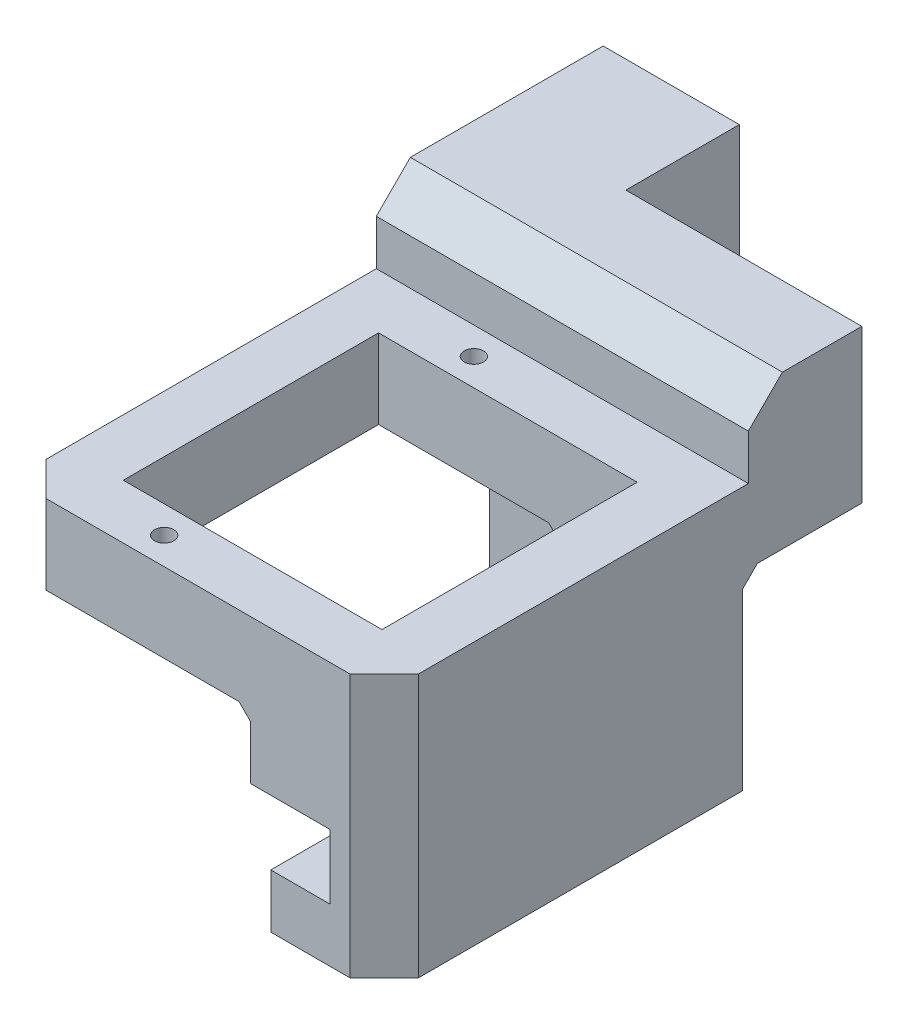
ISO-10303-21;
HEADER;
FILE_DESCRIPTION(('STEP AP214'),'2;1');
FILE_NAME('part.step','',(''),(''),'','','');
FILE_SCHEMA(('AUTOMOTIVE_DESIGN { 1 0 10303 214 1 1 1 1 }'));
ENDSEC;
DATA;
#1=APPLICATION_CONTEXT('core data for automotive mechanical design processes');
#2=APPLICATION_PROTOCOL_DEFINITION('international standard','automotive_design',2000,#1);
#3=PRODUCT_CONTEXT('',#1,'mechanical');
#4=PRODUCT('Part','Part','',(#3));
#5=PRODUCT_RELATED_PRODUCT_CATEGORY('part','',(#4));
#6=PRODUCT_DEFINITION_FORMATION('','',#4);
#7=PRODUCT_DEFINITION_CONTEXT('part definition',#1,'design');
#8=PRODUCT_DEFINITION('design','',#6,#7);
#9=PRODUCT_DEFINITION_SHAPE('','',#8);
#10=(LENGTH_UNIT() NAMED_UNIT(*) SI_UNIT(.MILLI.,.METRE.));
#11=(NAMED_UNIT(*) PLANE_ANGLE_UNIT() SI_UNIT($,.RADIAN.));
#12=(NAMED_UNIT(*) SI_UNIT($,.STERADIAN.) SOLID_ANGLE_UNIT());
#13=UNCERTAINTY_MEASURE_WITH_UNIT(LENGTH_MEASURE(1.E-05),#10,'distance_accuracy_value','');
#14=(GEOMETRIC_REPRESENTATION_CONTEXT(3) GLOBAL_UNCERTAINTY_ASSIGNED_CONTEXT((#13)) GLOBAL_UNIT_ASSIGNED_CONTEXT((#10,
#11,#12)) REPRESENTATION_CONTEXT('',''));
#15=CARTESIAN_POINT('',(0.,0.,0.));
#16=DIRECTION('',(0.,0.,1.));
#17=DIRECTION('',(1.,0.,0.));
#18=AXIS2_PLACEMENT_3D('',#15,#16,#17);
#19=CARTESIAN_POINT('',(0.,7.,-16.05));
#20=DIRECTION('',(0.,0.,1.));
#21=DIRECTION('',(1.,0.,0.));
#22=AXIS2_PLACEMENT_3D('',#19,#20,#21);
#23=PLANE('',#22);
#24=DIRECTION('',(0.,1.,0.));
#25=VECTOR('',#24,1.);
#26=CARTESIAN_POINT('',(28.,7.,-16.05));
#27=LINE('',#26,#25);
#28=CARTESIAN_POINT('',(28.,-11.45,-16.05));
#29=VERTEX_POINT('',#28);
#30=CARTESIAN_POINT('',(28.,-5.75,-16.05));
#31=VERTEX_POINT('',#30);
#32=EDGE_CURVE('E242',#29,#31,#27,.T.);
#33=ORIENTED_EDGE('',*,*,#32,.T.);
#34=DIRECTION('',(-1.,0.,0.));
#35=VECTOR('',#34,1.);
#36=CARTESIAN_POINT('',(0.,-5.75,-16.05));
#37=LINE('',#36,#35);
#38=CARTESIAN_POINT('',(21.,-5.75,-16.05));
#39=VERTEX_POINT('',#38);
#40=EDGE_CURVE('E248',#31,#39,#37,.T.);
#41=ORIENTED_EDGE('',*,*,#40,.T.);
#42=DIRECTION('',(0.,1.,0.));
#43=VECTOR('',#42,1.);
#44=CARTESIAN_POINT('',(21.,0.,-16.05));
#45=LINE('',#44,#43);
#46=CARTESIAN_POINT('',(21.,-1.,-16.05));
#47=VERTEX_POINT('',#46);
#48=EDGE_CURVE('E326',#39,#47,#45,.T.);
#49=ORIENTED_EDGE('',*,*,#48,.T.);
#50=DIRECTION('',(1.,0.,0.));
#51=VECTOR('',#50,1.);
#52=CARTESIAN_POINT('',(0.,-1.,-16.05));
#53=LINE('',#52,#51);
#54=CARTESIAN_POINT('',(32.3,-1.,-16.05));
#55=VERTEX_POINT('',#54);
#56=EDGE_CURVE('E409',#47,#55,#53,.T.);
#57=ORIENTED_EDGE('',*,*,#56,.T.);
#58=DIRECTION('',(0.,-1.,0.));
#59=VECTOR('',#58,1.);
#60=CARTESIAN_POINT('',(32.3,-16.2,-16.05));
#61=LINE('',#60,#59);
#62=CARTESIAN_POINT('',(32.3,-15.7,-16.05));
#63=VERTEX_POINT('',#62);
#64=EDGE_CURVE('E454',#55,#63,#61,.T.);
#65=ORIENTED_EDGE('',*,*,#64,.T.);
#66=DIRECTION('',(-1.,0.,0.));
#67=VECTOR('',#66,1.);
#68=CARTESIAN_POINT('',(0.,-15.7,-16.05));
#69=LINE('',#68,#67);
#70=CARTESIAN_POINT('',(22.8,-15.7,-16.05));
#71=VERTEX_POINT('',#70);
#72=EDGE_CURVE('E452',#63,#71,#69,.T.);
#73=ORIENTED_EDGE('',*,*,#72,.T.);
#74=DIRECTION('',(0.,1.,0.));
#75=VECTOR('',#74,1.);
#76=CARTESIAN_POINT('',(22.8,-16.2,-16.05));
#77=LINE('',#76,#75);
#78=CARTESIAN_POINT('',(22.8,-11.45,-16.05));
#79=VERTEX_POINT('',#78);
#80=EDGE_CURVE('E342',#71,#79,#77,.T.);
#81=ORIENTED_EDGE('',*,*,#80,.T.);
#82=DIRECTION('',(1.,0.,0.));
#83=VECTOR('',#82,1.);
#84=CARTESIAN_POINT('',(0.,-11.45,-16.05));
#85=LINE('',#84,#83);
#86=EDGE_CURVE('E49',#79,#29,#85,.T.);
#87=ORIENTED_EDGE('',*,*,#86,.T.);
#88=EDGE_LOOP('',(#33,#41,#49,#57,#65,#73,#81,#87));
#89=FACE_BOUND('',#88,.T.);
#90=ADVANCED_FACE('F34',(#89),#23,.F.);
#91=CARTESIAN_POINT('',(0.,7.,0.));
#92=DIRECTION('',(0.,-1.,0.));
#93=DIRECTION('',(0.,0.,-1.));
#94=AXIS2_PLACEMENT_3D('',#91,#92,#93);
#95=PLANE('',#94);
#96=DIRECTION('',(0.,0.,-1.));
#97=VECTOR('',#96,1.);
#98=CARTESIAN_POINT('',(27.8,7.,11.25));
#99=LINE('',#98,#97);
#100=CARTESIAN_POINT('',(27.8,7.,11.25));
#101=VERTEX_POINT('',#100);
#102=CARTESIAN_POINT('',(27.8,7.,-11.25));
#103=VERTEX_POINT('',#102);
#104=EDGE_CURVE('E348',#101,#103,#99,.T.);
#105=ORIENTED_EDGE('',*,*,#104,.F.);
#106=DIRECTION('',(-1.,0.,0.));
#107=VECTOR('',#106,1.);
#108=CARTESIAN_POINT('',(17.,7.,11.25));
#109=LINE('',#108,#107);
#110=CARTESIAN_POINT('',(5.,7.,11.25));
#111=VERTEX_POINT('',#110);
#112=EDGE_CURVE('E380',#101,#111,#109,.T.);
#113=ORIENTED_EDGE('',*,*,#112,.T.);
#114=DIRECTION('',(0.,0.,-1.));
#115=VECTOR('',#114,1.);
#116=CARTESIAN_POINT('',(5.,7.,-11.25));
#117=LINE('',#116,#115);
#118=CARTESIAN_POINT('',(5.,7.,-11.25));
#119=VERTEX_POINT('',#118);
#120=EDGE_CURVE('E382',#111,#119,#117,.T.);
#121=ORIENTED_EDGE('',*,*,#120,.T.);
#122=DIRECTION('',(1.,0.,0.));
#123=VECTOR('',#122,1.);
#124=CARTESIAN_POINT('',(17.,7.,-11.25));
#125=LINE('',#124,#123);
#126=EDGE_CURVE('E384',#119,#103,#125,.T.);
#127=ORIENTED_EDGE('',*,*,#126,.T.);
#128=EDGE_LOOP('',(#105,#113,#121,#127));
#129=FACE_BOUND('',#128,.T.);
#130=DIRECTION('',(1.,0.,0.));
#131=VECTOR('',#130,1.);
#132=CARTESIAN_POINT('',(0.,7.,16.05));
#133=LINE('',#132,#131);
#134=CARTESIAN_POINT('',(3.,7.,16.05));
#135=VERTEX_POINT('',#134);
#136=CARTESIAN_POINT('',(29.8,7.,16.05));
#137=VERTEX_POINT('',#136);
#138=EDGE_CURVE('E376',#135,#137,#133,.T.);
#139=ORIENTED_EDGE('',*,*,#138,.T.);
#140=DIRECTION('',(0.707106781186549,0.,-0.707106781186546));
#141=VECTOR('',#140,1.);
#142=CARTESIAN_POINT('',(32.8,7.,13.05));
#143=LINE('',#142,#141);
#144=CARTESIAN_POINT('',(32.8,7.,13.05));
#145=VERTEX_POINT('',#144);
#146=EDGE_CURVE('E424',#137,#145,#143,.T.);
#147=ORIENTED_EDGE('',*,*,#146,.T.);
#148=DIRECTION('',(0.,0.,1.));
#149=VECTOR('',#148,1.);
#150=CARTESIAN_POINT('',(32.8,7.,16.05));
#151=LINE('',#150,#149);
#152=CARTESIAN_POINT('',(32.8,7.,-16.05));
#153=VERTEX_POINT('',#152);
#154=EDGE_CURVE('E351',#153,#145,#151,.T.);
#155=ORIENTED_EDGE('',*,*,#154,.F.);
#156=DIRECTION('',(-1.,0.,0.));
#157=VECTOR('',#156,1.);
#158=CARTESIAN_POINT('',(32.8,7.,-16.05));
#159=LINE('',#158,#157);
#160=CARTESIAN_POINT('',(0.,7.,-16.05));
#161=VERTEX_POINT('',#160);
#162=EDGE_CURVE('E305',#153,#161,#159,.T.);
#163=ORIENTED_EDGE('',*,*,#162,.T.);
#164=DIRECTION('',(0.,0.,1.));
#165=VECTOR('',#164,1.);
#166=CARTESIAN_POINT('',(0.,7.,16.05));
#167=LINE('',#166,#165);
#168=CARTESIAN_POINT('',(0.,7.,13.05));
#169=VERTEX_POINT('',#168);
#170=EDGE_CURVE('E373',#161,#169,#167,.T.);
#171=ORIENTED_EDGE('',*,*,#170,.T.);
#172=DIRECTION('',(-0.707106781186547,0.,-0.707106781186548));
#173=VECTOR('',#172,1.);
#174=CARTESIAN_POINT('',(3.,7.,16.05));
#175=LINE('',#174,#173);
#176=EDGE_CURVE('E422',#169,#135,#175,.F.);
#177=ORIENTED_EDGE('',*,*,#176,.T.);
#178=EDGE_LOOP('',(#139,#147,#155,#163,#171,#177));
#179=FACE_BOUND('',#178,.T.);
#180=CARTESIAN_POINT('',(11.,7.,-13.65));
#181=DIRECTION('',(0.,1.,0.));
#182=DIRECTION('',(0.,0.,1.));
#183=AXIS2_PLACEMENT_3D('',#180,#181,#182);
#184=CIRCLE('',#183,0.85);
#185=CARTESIAN_POINT('',(11.,7.,-12.8));
#186=VERTEX_POINT('',#185);
#187=EDGE_CURVE('E367',#186,#186,#184,.T.);
#188=ORIENTED_EDGE('',*,*,#187,.F.);
#189=EDGE_LOOP('',(#188));
#190=FACE_BOUND('',#189,.T.);
#191=CARTESIAN_POINT('',(11.,7.,13.65));
#192=DIRECTION('',(0.,1.,0.));
#193=DIRECTION('',(0.,0.,-1.));
#194=AXIS2_PLACEMENT_3D('',#191,#192,#193);
#195=CIRCLE('',#194,0.85);
#196=CARTESIAN_POINT('',(11.,7.,12.8));
#197=VERTEX_POINT('',#196);
#198=EDGE_CURVE('E361',#197,#197,#195,.T.);
#199=ORIENTED_EDGE('',*,*,#198,.F.);
#200=EDGE_LOOP('',(#199));
#201=FACE_BOUND('',#200,.T.);
#202=ADVANCED_FACE('F538',(#129,#179,#190,#201),#95,.F.);
#203=CARTESIAN_POINT('',(0.,0.,0.));
#204=DIRECTION('',(0.,-1.,0.));
#205=DIRECTION('',(0.,0.,-1.));
#206=AXIS2_PLACEMENT_3D('',#203,#204,#205);
#207=PLANE('',#206);
#208=DIRECTION('',(-1.,0.,0.));
#209=VECTOR('',#208,1.);
#210=CARTESIAN_POINT('',(17.,0.,11.25));
#211=LINE('',#210,#209);
#212=CARTESIAN_POINT('',(20.,0.,11.25));
#213=VERTEX_POINT('',#212);
#214=CARTESIAN_POINT('',(5.,0.,11.25));
#215=VERTEX_POINT('',#214);
#216=EDGE_CURVE('E392',#213,#215,#211,.T.);
#217=ORIENTED_EDGE('',*,*,#216,.F.);
#218=DIRECTION('',(0.,0.,1.));
#219=VECTOR('',#218,1.);
#220=CARTESIAN_POINT('',(20.,0.,16.05));
#221=LINE('',#220,#219);
#222=CARTESIAN_POINT('',(20.,0.,16.05));
#223=VERTEX_POINT('',#222);
#224=EDGE_CURVE('E469',#213,#223,#221,.T.);
#225=ORIENTED_EDGE('',*,*,#224,.T.);
#226=DIRECTION('',(1.,0.,0.));
#227=VECTOR('',#226,1.);
#228=CARTESIAN_POINT('',(0.,0.,16.05));
#229=LINE('',#228,#227);
#230=CARTESIAN_POINT('',(3.,0.,16.05));
#231=VERTEX_POINT('',#230);
#232=EDGE_CURVE('E389',#231,#223,#229,.T.);
#233=ORIENTED_EDGE('',*,*,#232,.F.);
#234=DIRECTION('',(0.707106781186547,0.,0.707106781186548));
#235=VECTOR('',#234,1.);
#236=CARTESIAN_POINT('',(-6.525,0.,6.52499999999998));
#237=LINE('',#236,#235);
#238=CARTESIAN_POINT('',(0.,0.,13.05));
#239=VERTEX_POINT('',#238);
#240=EDGE_CURVE('E426',#231,#239,#237,.F.);
#241=ORIENTED_EDGE('',*,*,#240,.T.);
#242=DIRECTION('',(0.,0.,1.));
#243=VECTOR('',#242,1.);
#244=CARTESIAN_POINT('',(0.,0.,16.05));
#245=LINE('',#244,#243);
#246=CARTESIAN_POINT('',(0.,0.,-26.05));
#247=VERTEX_POINT('',#246);
#248=EDGE_CURVE('E370',#247,#239,#245,.T.);
#249=ORIENTED_EDGE('',*,*,#248,.F.);
#250=DIRECTION('',(-1.,0.,0.));
#251=VECTOR('',#250,1.);
#252=CARTESIAN_POINT('',(45.0065556157337,0.,-26.05));
#253=LINE('',#252,#251);
#254=CARTESIAN_POINT('',(12.,0.,-26.05));
#255=VERTEX_POINT('',#254);
#256=EDGE_CURVE('E323',#255,#247,#253,.T.);
#257=ORIENTED_EDGE('',*,*,#256,.F.);
#258=CARTESIAN_POINT('',(32.3,0.,-26.05));
#259=VERTEX_POINT('',#258);
#260=EDGE_CURVE('E324',#259,#255,#253,.T.);
#261=ORIENTED_EDGE('',*,*,#260,.F.);
#262=DIRECTION('',(0.,0.,1.));
#263=VECTOR('',#262,1.);
#264=CARTESIAN_POINT('',(32.3,0.,0.));
#265=LINE('',#264,#263);
#266=CARTESIAN_POINT('',(32.3,0.,-17.05));
#267=VERTEX_POINT('',#266);
#268=EDGE_CURVE('E439',#259,#267,#265,.T.);
#269=ORIENTED_EDGE('',*,*,#268,.T.);
#270=DIRECTION('',(-1.,0.,0.));
#271=VECTOR('',#270,1.);
#272=CARTESIAN_POINT('',(0.,0.,-17.05));
#273=LINE('',#272,#271);
#274=CARTESIAN_POINT('',(20.,0.,-17.05));
#275=VERTEX_POINT('',#274);
#276=EDGE_CURVE('E407',#267,#275,#273,.T.);
#277=ORIENTED_EDGE('',*,*,#276,.T.);
#278=DIRECTION('',(0.,0.,1.));
#279=VECTOR('',#278,1.);
#280=CARTESIAN_POINT('',(20.,0.,-11.25));
#281=LINE('',#280,#279);
#282=CARTESIAN_POINT('',(20.,0.,-11.25));
#283=VERTEX_POINT('',#282);
#284=EDGE_CURVE('E460',#275,#283,#281,.T.);
#285=ORIENTED_EDGE('',*,*,#284,.T.);
#286=DIRECTION('',(1.,0.,0.));
#287=VECTOR('',#286,1.);
#288=CARTESIAN_POINT('',(17.,0.,-11.25));
#289=LINE('',#288,#287);
#290=CARTESIAN_POINT('',(5.,0.,-11.25));
#291=VERTEX_POINT('',#290);
#292=EDGE_CURVE('E377',#291,#283,#289,.T.);
#293=ORIENTED_EDGE('',*,*,#292,.F.);
#294=DIRECTION('',(0.,0.,-1.));
#295=VECTOR('',#294,1.);
#296=CARTESIAN_POINT('',(5.,0.,-11.25));
#297=LINE('',#296,#295);
#298=EDGE_CURVE('E396',#215,#291,#297,.T.);
#299=ORIENTED_EDGE('',*,*,#298,.F.);
#300=EDGE_LOOP('',(#217,#225,#233,#241,#249,#257,#261,#269,#277,#285,#293,#299));
#301=FACE_BOUND('',#300,.T.);
#302=CARTESIAN_POINT('',(11.,0.,-13.65));
#303=DIRECTION('',(0.,1.,0.));
#304=DIRECTION('',(0.,0.,1.));
#305=AXIS2_PLACEMENT_3D('',#302,#303,#304);
#306=CIRCLE('',#305,0.85);
#307=CARTESIAN_POINT('',(11.,0.,-12.8));
#308=VERTEX_POINT('',#307);
#309=EDGE_CURVE('E364',#308,#308,#306,.T.);
#310=ORIENTED_EDGE('',*,*,#309,.T.);
#311=EDGE_LOOP('',(#310));
#312=FACE_BOUND('',#311,.T.);
#313=CARTESIAN_POINT('',(11.,0.,13.65));
#314=DIRECTION('',(0.,1.,0.));
#315=DIRECTION('',(0.,0.,-1.));
#316=AXIS2_PLACEMENT_3D('',#313,#314,#315);
#317=CIRCLE('',#316,0.85);
#318=CARTESIAN_POINT('',(11.,0.,12.8));
#319=VERTEX_POINT('',#318);
#320=EDGE_CURVE('E358',#319,#319,#317,.T.);
#321=ORIENTED_EDGE('',*,*,#320,.T.);
#322=EDGE_LOOP('',(#321));
#323=FACE_BOUND('',#322,.T.);
#324=ADVANCED_FACE('F509',(#301,#312,#323),#207,.T.);
#325=CARTESIAN_POINT('',(0.,7.,16.05));
#326=DIRECTION('',(1.,0.,0.));
#327=DIRECTION('',(0.,0.,-1.));
#328=AXIS2_PLACEMENT_3D('',#325,#326,#327);
#329=PLANE('',#328);
#330=DIRECTION('',(0.,1.,0.));
#331=VECTOR('',#330,1.);
#332=CARTESIAN_POINT('',(0.,7.,-16.05));
#333=LINE('',#332,#331);
#334=CARTESIAN_POINT('',(0.,11.,-16.05));
#335=VERTEX_POINT('',#334);
#336=EDGE_CURVE('E309',#161,#335,#333,.T.);
#337=ORIENTED_EDGE('',*,*,#336,.T.);
#338=DIRECTION('',(0.,-0.707106781186546,0.707106781186549));
#339=VECTOR('',#338,1.);
#340=CARTESIAN_POINT('',(0.,11.,-16.05));
#341=LINE('',#340,#339);
#342=CARTESIAN_POINT('',(0.,14.,-19.05));
#343=VERTEX_POINT('',#342);
#344=EDGE_CURVE('E433',#335,#343,#341,.F.);
#345=ORIENTED_EDGE('',*,*,#344,.T.);
#346=DIRECTION('',(0.,0.,1.));
#347=VECTOR('',#346,1.);
#348=CARTESIAN_POINT('',(0.,14.,-26.05));
#349=LINE('',#348,#347);
#350=CARTESIAN_POINT('',(0.,14.,-36.05));
#351=VERTEX_POINT('',#350);
#352=EDGE_CURVE('E315',#351,#343,#349,.T.);
#353=ORIENTED_EDGE('',*,*,#352,.F.);
#354=DIRECTION('',(0.,1.,0.));
#355=VECTOR('',#354,1.);
#356=CARTESIAN_POINT('',(0.,14.,-36.05));
#357=LINE('',#356,#355);
#358=CARTESIAN_POINT('',(0.,-31.14,-36.05));
#359=VERTEX_POINT('',#358);
#360=EDGE_CURVE('E274',#359,#351,#357,.T.);
#361=ORIENTED_EDGE('',*,*,#360,.F.);
#362=DIRECTION('',(0.,0.,1.));
#363=VECTOR('',#362,1.);
#364=CARTESIAN_POINT('',(0.,-31.14,-36.05));
#365=LINE('',#364,#363);
#366=CARTESIAN_POINT('',(0.,-31.14,-26.05));
#367=VERTEX_POINT('',#366);
#368=EDGE_CURVE('E284',#359,#367,#365,.T.);
#369=ORIENTED_EDGE('',*,*,#368,.T.);
#370=DIRECTION('',(0.,1.,0.));
#371=VECTOR('',#370,1.);
#372=CARTESIAN_POINT('',(0.,14.,-26.05));
#373=LINE('',#372,#371);
#374=EDGE_CURVE('E265',#367,#247,#373,.T.);
#375=ORIENTED_EDGE('',*,*,#374,.T.);
#376=ORIENTED_EDGE('',*,*,#248,.T.);
#377=DIRECTION('',(0.,1.,0.));
#378=VECTOR('',#377,1.);
#379=CARTESIAN_POINT('',(0.,7.,13.05));
#380=LINE('',#379,#378);
#381=EDGE_CURVE('E428',#239,#169,#380,.T.);
#382=ORIENTED_EDGE('',*,*,#381,.T.);
#383=ORIENTED_EDGE('',*,*,#170,.F.);
#384=EDGE_LOOP('',(#337,#345,#353,#361,#369,#375,#376,#382,#383));
#385=FACE_BOUND('',#384,.T.);
#386=ADVANCED_FACE('F558',(#385),#329,.F.);
#387=CARTESIAN_POINT('',(0.,7.,16.05));
#388=DIRECTION('',(0.,0.,-1.));
#389=DIRECTION('',(-1.,0.,0.));
#390=AXIS2_PLACEMENT_3D('',#387,#388,#389);
#391=PLANE('',#390);
#392=DIRECTION('',(0.,-1.,0.));
#393=VECTOR('',#392,1.);
#394=CARTESIAN_POINT('',(21.,0.,16.05));
#395=LINE('',#394,#393);
#396=CARTESIAN_POINT('',(21.,-1.00000000000001,16.05));
#397=VERTEX_POINT('',#396);
#398=CARTESIAN_POINT('',(21.,-5.75,16.05));
#399=VERTEX_POINT('',#398);
#400=EDGE_CURVE('E253',#397,#399,#395,.T.);
#401=ORIENTED_EDGE('',*,*,#400,.T.);
#402=DIRECTION('',(-1.,0.,0.));
#403=VECTOR('',#402,1.);
#404=CARTESIAN_POINT('',(21.,-5.75,16.05));
#405=LINE('',#404,#403);
#406=CARTESIAN_POINT('',(28.,-5.75,16.05));
#407=VERTEX_POINT('',#406);
#408=EDGE_CURVE('E56',#407,#399,#405,.T.);
#409=ORIENTED_EDGE('',*,*,#408,.F.);
#410=DIRECTION('',(0.,1.,0.));
#411=VECTOR('',#410,1.);
#412=CARTESIAN_POINT('',(28.,-11.2,16.05));
#413=LINE('',#412,#411);
#414=CARTESIAN_POINT('',(28.,-11.45,16.05));
#415=VERTEX_POINT('',#414);
#416=EDGE_CURVE('E235',#415,#407,#413,.T.);
#417=ORIENTED_EDGE('',*,*,#416,.F.);
#418=DIRECTION('',(1.,0.,0.));
#419=VECTOR('',#418,1.);
#420=CARTESIAN_POINT('',(21.,-11.45,16.05));
#421=LINE('',#420,#419);
#422=CARTESIAN_POINT('',(22.8,-11.45,16.05));
#423=VERTEX_POINT('',#422);
#424=EDGE_CURVE('E255',#423,#415,#421,.T.);
#425=ORIENTED_EDGE('',*,*,#424,.F.);
#426=DIRECTION('',(0.,1.,0.));
#427=VECTOR('',#426,1.);
#428=CARTESIAN_POINT('',(22.8,-16.2,16.05));
#429=LINE('',#428,#427);
#430=CARTESIAN_POINT('',(22.8,-16.2,16.05));
#431=VERTEX_POINT('',#430);
#432=EDGE_CURVE('E243',#431,#423,#429,.T.);
#433=ORIENTED_EDGE('',*,*,#432,.F.);
#434=DIRECTION('',(-1.,0.,0.));
#435=VECTOR('',#434,1.);
#436=CARTESIAN_POINT('',(32.8,-16.2,16.05));
#437=LINE('',#436,#435);
#438=CARTESIAN_POINT('',(29.8,-16.2,16.05));
#439=VERTEX_POINT('',#438);
#440=EDGE_CURVE('E337',#439,#431,#437,.T.);
#441=ORIENTED_EDGE('',*,*,#440,.F.);
#442=DIRECTION('',(0.,1.,0.));
#443=VECTOR('',#442,1.);
#444=CARTESIAN_POINT('',(29.8,7.,16.05));
#445=LINE('',#444,#443);
#446=EDGE_CURVE('E420',#439,#137,#445,.T.);
#447=ORIENTED_EDGE('',*,*,#446,.T.);
#448=ORIENTED_EDGE('',*,*,#138,.F.);
#449=DIRECTION('',(0.,-1.,0.));
#450=VECTOR('',#449,1.);
#451=CARTESIAN_POINT('',(3.,7.,16.05));
#452=LINE('',#451,#450);
#453=EDGE_CURVE('E417',#135,#231,#452,.T.);
#454=ORIENTED_EDGE('',*,*,#453,.T.);
#455=ORIENTED_EDGE('',*,*,#232,.T.);
#456=DIRECTION('',(-0.707106781186552,0.707106781186543,0.));
#457=VECTOR('',#456,1.);
#458=CARTESIAN_POINT('',(6.49999999999984,13.4999999999999,16.05));
#459=LINE('',#458,#457);
#460=EDGE_CURVE('E483',#223,#397,#459,.F.);
#461=ORIENTED_EDGE('',*,*,#460,.T.);
#462=EDGE_LOOP('',(#401,#409,#417,#425,#433,#441,#447,#448,#454,#455,#461));
#463=FACE_BOUND('',#462,.T.);
#464=ADVANCED_FACE('F251',(#463),#391,.F.);
#465=CARTESIAN_POINT('',(17.,7.,11.25));
#466=DIRECTION('',(0.,0.,1.));
#467=DIRECTION('',(1.,0.,0.));
#468=AXIS2_PLACEMENT_3D('',#465,#466,#467);
#469=PLANE('',#468);
#470=DIRECTION('',(0.,-1.,0.));
#471=VECTOR('',#470,1.);
#472=CARTESIAN_POINT('',(27.8,7.,11.25));
#473=LINE('',#472,#471);
#474=CARTESIAN_POINT('',(27.8,0.,11.25));
#475=VERTEX_POINT('',#474);
#476=EDGE_CURVE('E354',#101,#475,#473,.T.);
#477=ORIENTED_EDGE('',*,*,#476,.T.);
#478=CARTESIAN_POINT('',(21.,0.,11.25));
#479=VERTEX_POINT('',#478);
#480=EDGE_CURVE('E393',#475,#479,#211,.T.);
#481=ORIENTED_EDGE('',*,*,#480,.T.);
#482=DIRECTION('',(0.,1.,0.));
#483=VECTOR('',#482,1.);
#484=CARTESIAN_POINT('',(21.,0.,11.25));
#485=LINE('',#484,#483);
#486=CARTESIAN_POINT('',(21.,-1.00000000000001,11.25));
#487=VERTEX_POINT('',#486);
#488=EDGE_CURVE('E478',#487,#479,#485,.T.);
#489=ORIENTED_EDGE('',*,*,#488,.F.);
#490=DIRECTION('',(0.707106781186552,-0.707106781186543,0.));
#491=VECTOR('',#490,1.);
#492=CARTESIAN_POINT('',(15.,4.99999999999994,11.25));
#493=LINE('',#492,#491);
#494=EDGE_CURVE('E485',#487,#213,#493,.F.);
#495=ORIENTED_EDGE('',*,*,#494,.T.);
#496=ORIENTED_EDGE('',*,*,#216,.T.);
#497=DIRECTION('',(0.,-1.,0.));
#498=VECTOR('',#497,1.);
#499=CARTESIAN_POINT('',(5.,7.,11.25));
#500=LINE('',#499,#498);
#501=EDGE_CURVE('E402',#111,#215,#500,.T.);
#502=ORIENTED_EDGE('',*,*,#501,.F.);
#503=ORIENTED_EDGE('',*,*,#112,.F.);
#504=EDGE_LOOP('',(#477,#481,#489,#495,#496,#502,#503));
#505=FACE_BOUND('',#504,.T.);
#506=ADVANCED_FACE('F532',(#505),#469,.F.);
#507=CARTESIAN_POINT('',(5.,7.,-11.25));
#508=DIRECTION('',(-1.,0.,0.));
#509=DIRECTION('',(0.,0.,1.));
#510=AXIS2_PLACEMENT_3D('',#507,#508,#509);
#511=PLANE('',#510);
#512=ORIENTED_EDGE('',*,*,#298,.T.);
#513=DIRECTION('',(0.,-1.,0.));
#514=VECTOR('',#513,1.);
#515=CARTESIAN_POINT('',(5.,7.,-11.25));
#516=LINE('',#515,#514);
#517=EDGE_CURVE('E386',#119,#291,#516,.T.);
#518=ORIENTED_EDGE('',*,*,#517,.F.);
#519=ORIENTED_EDGE('',*,*,#120,.F.);
#520=ORIENTED_EDGE('',*,*,#501,.T.);
#521=EDGE_LOOP('',(#512,#518,#519,#520));
#522=FACE_BOUND('',#521,.T.);
#523=ADVANCED_FACE('F519',(#522),#511,.F.);
#524=CARTESIAN_POINT('',(17.,7.,-11.25));
#525=DIRECTION('',(0.,0.,-1.));
#526=DIRECTION('',(-1.,0.,0.));
#527=AXIS2_PLACEMENT_3D('',#524,#525,#526);
#528=PLANE('',#527);
#529=ORIENTED_EDGE('',*,*,#292,.T.);
#530=DIRECTION('',(-0.707106781186552,0.707106781186543,0.));
#531=VECTOR('',#530,1.);
#532=CARTESIAN_POINT('',(15.,4.99999999999993,-11.25));
#533=LINE('',#532,#531);
#534=CARTESIAN_POINT('',(21.,-1.00000000000001,-11.25));
#535=VERTEX_POINT('',#534);
#536=EDGE_CURVE('E487',#283,#535,#533,.F.);
#537=ORIENTED_EDGE('',*,*,#536,.T.);
#538=DIRECTION('',(0.,-1.,0.));
#539=VECTOR('',#538,1.);
#540=CARTESIAN_POINT('',(21.,0.,-11.25));
#541=LINE('',#540,#539);
#542=CARTESIAN_POINT('',(21.,0.,-11.25));
#543=VERTEX_POINT('',#542);
#544=EDGE_CURVE('E475',#543,#535,#541,.T.);
#545=ORIENTED_EDGE('',*,*,#544,.F.);
#546=DIRECTION('',(1.,0.,0.));
#547=VECTOR('',#546,1.);
#548=CARTESIAN_POINT('',(17.,0.,-11.25));
#549=LINE('',#548,#547);
#550=CARTESIAN_POINT('',(27.8,0.,-11.25));
#551=VERTEX_POINT('',#550);
#552=EDGE_CURVE('E328',#543,#551,#549,.T.);
#553=ORIENTED_EDGE('',*,*,#552,.T.);
#554=DIRECTION('',(0.,-1.,0.));
#555=VECTOR('',#554,1.);
#556=CARTESIAN_POINT('',(27.8,7.,-11.25));
#557=LINE('',#556,#555);
#558=EDGE_CURVE('E355',#103,#551,#557,.T.);
#559=ORIENTED_EDGE('',*,*,#558,.F.);
#560=ORIENTED_EDGE('',*,*,#126,.F.);
#561=ORIENTED_EDGE('',*,*,#517,.T.);
#562=EDGE_LOOP('',(#529,#537,#545,#553,#559,#560,#561));
#563=FACE_BOUND('',#562,.T.);
#564=ADVANCED_FACE('F513',(#563),#528,.F.);
#565=CARTESIAN_POINT('',(11.,7.,-13.65));
#566=DIRECTION('',(0.,-1.,0.));
#567=DIRECTION('',(0.,0.,-1.));
#568=AXIS2_PLACEMENT_3D('',#565,#566,#567);
#569=CYLINDRICAL_SURFACE('',#568,0.85);
#570=ORIENTED_EDGE('',*,*,#187,.T.);
#571=EDGE_LOOP('',(#570));
#572=FACE_BOUND('',#571,.T.);
#573=ORIENTED_EDGE('',*,*,#309,.F.);
#574=EDGE_LOOP('',(#573));
#575=FACE_BOUND('',#574,.T.);
#576=ADVANCED_FACE('F553',(#572,#575),#569,.F.);
#577=CARTESIAN_POINT('',(11.,7.,13.65));
#578=DIRECTION('',(0.,-1.,0.));
#579=DIRECTION('',(0.,0.,-1.));
#580=AXIS2_PLACEMENT_3D('',#577,#578,#579);
#581=CYLINDRICAL_SURFACE('',#580,0.85);
#582=ORIENTED_EDGE('',*,*,#198,.T.);
#583=EDGE_LOOP('',(#582));
#584=FACE_BOUND('',#583,.T.);
#585=ORIENTED_EDGE('',*,*,#320,.F.);
#586=EDGE_LOOP('',(#585));
#587=FACE_BOUND('',#586,.T.);
#588=ADVANCED_FACE('F549',(#584,#587),#581,.F.);
#589=CARTESIAN_POINT('',(32.8,7.,16.05));
#590=DIRECTION('',(1.,0.,0.));
#591=DIRECTION('',(0.,0.,-1.));
#592=AXIS2_PLACEMENT_3D('',#589,#590,#591);
#593=PLANE('',#592);
#594=DIRECTION('',(0.,0.707106781186542,-0.707106781186553));
#595=VECTOR('',#594,1.);
#596=CARTESIAN_POINT('',(32.8,0.353553390593264,-16.6964466094068));
#597=LINE('',#596,#595);
#598=CARTESIAN_POINT('',(32.8,-0.792893218813462,-15.55));
#599=VERTEX_POINT('',#598);
#600=CARTESIAN_POINT('',(32.8,0.5,-16.8428932188135));
#601=VERTEX_POINT('',#600);
#602=EDGE_CURVE('E444',#599,#601,#597,.T.);
#603=ORIENTED_EDGE('',*,*,#602,.T.);
#604=DIRECTION('',(0.,0.,-1.));
#605=VECTOR('',#604,1.);
#606=CARTESIAN_POINT('',(32.8,0.5,16.05));
#607=LINE('',#606,#605);
#608=CARTESIAN_POINT('',(32.8,0.5,-26.05));
#609=VERTEX_POINT('',#608);
#610=EDGE_CURVE('E446',#601,#609,#607,.T.);
#611=ORIENTED_EDGE('',*,*,#610,.T.);
#612=DIRECTION('',(0.,-1.,0.));
#613=VECTOR('',#612,1.);
#614=CARTESIAN_POINT('',(32.8,7.,-26.05));
#615=LINE('',#614,#613);
#616=CARTESIAN_POINT('',(32.8,14.,-26.05));
#617=VERTEX_POINT('',#616);
#618=EDGE_CURVE('E318',#617,#609,#615,.T.);
#619=ORIENTED_EDGE('',*,*,#618,.F.);
#620=DIRECTION('',(0.,0.,1.));
#621=VECTOR('',#620,1.);
#622=CARTESIAN_POINT('',(32.8,14.,-26.05));
#623=LINE('',#622,#621);
#624=CARTESIAN_POINT('',(32.8,14.,-19.05));
#625=VERTEX_POINT('',#624);
#626=EDGE_CURVE('E304',#617,#625,#623,.T.);
#627=ORIENTED_EDGE('',*,*,#626,.T.);
#628=DIRECTION('',(0.,0.707106781186546,-0.707106781186549));
#629=VECTOR('',#628,1.);
#630=CARTESIAN_POINT('',(32.8,-7.04999999999999,2.00000000000008));
#631=LINE('',#630,#629);
#632=CARTESIAN_POINT('',(32.8,11.,-16.05));
#633=VERTEX_POINT('',#632);
#634=EDGE_CURVE('E437',#625,#633,#631,.F.);
#635=ORIENTED_EDGE('',*,*,#634,.T.);
#636=DIRECTION('',(0.,1.,0.));
#637=VECTOR('',#636,1.);
#638=CARTESIAN_POINT('',(32.8,7.,-16.05));
#639=LINE('',#638,#637);
#640=EDGE_CURVE('E306',#153,#633,#639,.T.);
#641=ORIENTED_EDGE('',*,*,#640,.F.);
#642=ORIENTED_EDGE('',*,*,#154,.T.);
#643=DIRECTION('',(0.,-1.,0.));
#644=VECTOR('',#643,1.);
#645=CARTESIAN_POINT('',(32.8,-16.2,13.05));
#646=LINE('',#645,#644);
#647=CARTESIAN_POINT('',(32.8,-16.2,13.05));
#648=VERTEX_POINT('',#647);
#649=EDGE_CURVE('E412',#145,#648,#646,.T.);
#650=ORIENTED_EDGE('',*,*,#649,.T.);
#651=DIRECTION('',(0.,0.,1.));
#652=VECTOR('',#651,1.);
#653=CARTESIAN_POINT('',(32.8,-16.2,16.05));
#654=LINE('',#653,#652);
#655=CARTESIAN_POINT('',(32.8,-16.2,-15.55));
#656=VERTEX_POINT('',#655);
#657=EDGE_CURVE('E335',#656,#648,#654,.T.);
#658=ORIENTED_EDGE('',*,*,#657,.F.);
#659=DIRECTION('',(0.,1.,0.));
#660=VECTOR('',#659,1.);
#661=CARTESIAN_POINT('',(32.8,-1.,-15.55));
#662=LINE('',#661,#660);
#663=EDGE_CURVE('E442',#656,#599,#662,.T.);
#664=ORIENTED_EDGE('',*,*,#663,.T.);
#665=EDGE_LOOP('',(#603,#611,#619,#627,#635,#641,#642,#650,#658,#664));
#666=FACE_BOUND('',#665,.T.);
#667=ADVANCED_FACE('F552',(#666),#593,.T.);
#668=CARTESIAN_POINT('',(27.8,7.,11.25));
#669=DIRECTION('',(-1.,0.,0.));
#670=DIRECTION('',(0.,0.,1.));
#671=AXIS2_PLACEMENT_3D('',#668,#669,#670);
#672=PLANE('',#671);
#673=DIRECTION('',(0.,0.,-1.));
#674=VECTOR('',#673,1.);
#675=CARTESIAN_POINT('',(27.8,0.,11.25));
#676=LINE('',#675,#674);
#677=EDGE_CURVE('E405',#475,#551,#676,.T.);
#678=ORIENTED_EDGE('',*,*,#677,.F.);
#679=ORIENTED_EDGE('',*,*,#476,.F.);
#680=ORIENTED_EDGE('',*,*,#104,.T.);
#681=ORIENTED_EDGE('',*,*,#558,.T.);
#682=EDGE_LOOP('',(#678,#679,#680,#681));
#683=FACE_BOUND('',#682,.T.);
#684=ADVANCED_FACE('F536',(#683),#672,.T.);
#685=CARTESIAN_POINT('',(28.,-11.2,-25.95));
#686=DIRECTION('',(1.,0.,0.));
#687=DIRECTION('',(0.,0.,-1.));
#688=AXIS2_PLACEMENT_3D('',#685,#686,#687);
#689=PLANE('',#688);
#690=ORIENTED_EDGE('',*,*,#416,.T.);
#691=DIRECTION('',(0.,0.,1.));
#692=VECTOR('',#691,1.);
#693=CARTESIAN_POINT('',(28.,-5.75,-22.95));
#694=LINE('',#693,#692);
#695=EDGE_CURVE('E237',#31,#407,#694,.T.);
#696=ORIENTED_EDGE('',*,*,#695,.F.);
#697=ORIENTED_EDGE('',*,*,#32,.F.);
#698=DIRECTION('',(0.,0.,1.));
#699=VECTOR('',#698,1.);
#700=CARTESIAN_POINT('',(28.,-11.45,-22.95));
#701=LINE('',#700,#699);
#702=EDGE_CURVE('E238',#29,#415,#701,.T.);
#703=ORIENTED_EDGE('',*,*,#702,.T.);
#704=EDGE_LOOP('',(#690,#696,#697,#703));
#705=FACE_BOUND('',#704,.T.);
#706=ADVANCED_FACE('F236',(#705),#689,.F.);
#707=CARTESIAN_POINT('',(22.8,-16.2,16.05));
#708=DIRECTION('',(1.,0.,0.));
#709=DIRECTION('',(0.,0.,-1.));
#710=AXIS2_PLACEMENT_3D('',#707,#708,#709);
#711=PLANE('',#710);
#712=ORIENTED_EDGE('',*,*,#432,.T.);
#713=DIRECTION('',(0.,0.,-1.));
#714=VECTOR('',#713,1.);
#715=CARTESIAN_POINT('',(22.8,-11.45,16.05));
#716=LINE('',#715,#714);
#717=EDGE_CURVE('E11',#423,#79,#716,.T.);
#718=ORIENTED_EDGE('',*,*,#717,.T.);
#719=ORIENTED_EDGE('',*,*,#80,.F.);
#720=DIRECTION('',(0.,0.707106781186557,-0.707106781186538));
#721=VECTOR('',#720,1.);
#722=CARTESIAN_POINT('',(22.8,-16.2,-15.55));
#723=LINE('',#722,#721);
#724=CARTESIAN_POINT('',(22.8,-16.2,-15.55));
#725=VERTEX_POINT('',#724);
#726=EDGE_CURVE('E458',#71,#725,#723,.F.);
#727=ORIENTED_EDGE('',*,*,#726,.T.);
#728=DIRECTION('',(0.,0.,-1.));
#729=VECTOR('',#728,1.);
#730=CARTESIAN_POINT('',(22.8,-16.2,16.05));
#731=LINE('',#730,#729);
#732=EDGE_CURVE('E339',#431,#725,#731,.T.);
#733=ORIENTED_EDGE('',*,*,#732,.F.);
#734=EDGE_LOOP('',(#712,#718,#719,#727,#733));
#735=FACE_BOUND('',#734,.T.);
#736=ADVANCED_FACE('F642',(#735),#711,.F.);
#737=CARTESIAN_POINT('',(0.,-16.2,0.));
#738=DIRECTION('',(0.,1.,0.));
#739=DIRECTION('',(0.,0.,1.));
#740=AXIS2_PLACEMENT_3D('',#737,#738,#739);
#741=PLANE('',#740);
#742=ORIENTED_EDGE('',*,*,#732,.T.);
#743=DIRECTION('',(1.,0.,0.));
#744=VECTOR('',#743,1.);
#745=CARTESIAN_POINT('',(0.,-16.2,-15.55));
#746=LINE('',#745,#744);
#747=EDGE_CURVE('E456',#725,#656,#746,.T.);
#748=ORIENTED_EDGE('',*,*,#747,.T.);
#749=ORIENTED_EDGE('',*,*,#657,.T.);
#750=DIRECTION('',(-0.707106781186549,0.,0.707106781186546));
#751=VECTOR('',#750,1.);
#752=CARTESIAN_POINT('',(32.8,-16.2,13.05));
#753=LINE('',#752,#751);
#754=EDGE_CURVE('E415',#648,#439,#753,.T.);
#755=ORIENTED_EDGE('',*,*,#754,.T.);
#756=ORIENTED_EDGE('',*,*,#440,.T.);
#757=EDGE_LOOP('',(#742,#748,#749,#755,#756));
#758=FACE_BOUND('',#757,.T.);
#759=ADVANCED_FACE('F639',(#758),#741,.F.);
#760=CARTESIAN_POINT('',(28.,0.,-25.2695444572929));
#761=DIRECTION('',(0.,1.,0.));
#762=DIRECTION('',(-1.,0.,0.));
#763=AXIS2_PLACEMENT_3D('',#760,#761,#762);
#764=PLANE('',#763);
#765=ORIENTED_EDGE('',*,*,#480,.F.);
#766=ORIENTED_EDGE('',*,*,#677,.T.);
#767=ORIENTED_EDGE('',*,*,#552,.F.);
#768=DIRECTION('',(0.,0.,1.));
#769=VECTOR('',#768,1.);
#770=CARTESIAN_POINT('',(21.,0.,-25.2695444572929));
#771=LINE('',#770,#769);
#772=EDGE_CURVE('E329',#543,#479,#771,.T.);
#773=ORIENTED_EDGE('',*,*,#772,.T.);
#774=EDGE_LOOP('',(#765,#766,#767,#773));
#775=FACE_BOUND('',#774,.T.);
#776=ADVANCED_FACE('F530',(#775),#764,.T.);
#777=CARTESIAN_POINT('',(21.,0.,-25.2695444572929));
#778=DIRECTION('',(-1.,0.,0.));
#779=DIRECTION('',(0.,0.,1.));
#780=AXIS2_PLACEMENT_3D('',#777,#778,#779);
#781=PLANE('',#780);
#782=DIRECTION('',(0.,0.,-1.));
#783=VECTOR('',#782,1.);
#784=CARTESIAN_POINT('',(21.,-5.75,-25.2695444572929));
#785=LINE('',#784,#783);
#786=EDGE_CURVE('E42',#399,#39,#785,.T.);
#787=ORIENTED_EDGE('',*,*,#786,.F.);
#788=ORIENTED_EDGE('',*,*,#400,.F.);
#789=DIRECTION('',(0.,0.,-1.));
#790=VECTOR('',#789,1.);
#791=CARTESIAN_POINT('',(21.,-1.00000000000001,11.25));
#792=LINE('',#791,#790);
#793=EDGE_CURVE('E480',#397,#487,#792,.T.);
#794=ORIENTED_EDGE('',*,*,#793,.T.);
#795=ORIENTED_EDGE('',*,*,#488,.T.);
#796=ORIENTED_EDGE('',*,*,#772,.F.);
#797=ORIENTED_EDGE('',*,*,#544,.T.);
#798=DIRECTION('',(0.,0.,-1.));
#799=VECTOR('',#798,1.);
#800=CARTESIAN_POINT('',(21.,-1.00000000000001,-17.05));
#801=LINE('',#800,#799);
#802=EDGE_CURVE('E472',#535,#47,#801,.T.);
#803=ORIENTED_EDGE('',*,*,#802,.T.);
#804=ORIENTED_EDGE('',*,*,#48,.F.);
#805=EDGE_LOOP('',(#787,#788,#794,#795,#796,#797,#803,#804));
#806=FACE_BOUND('',#805,.T.);
#807=ADVANCED_FACE('F494',(#806),#781,.T.);
#808=CARTESIAN_POINT('',(45.0065556157337,7.,-26.05));
#809=DIRECTION('',(0.,0.,-1.));
#810=DIRECTION('',(-1.,0.,0.));
#811=AXIS2_PLACEMENT_3D('',#808,#809,#810);
#812=PLANE('',#811);
#813=DIRECTION('',(0.,-1.,0.));
#814=VECTOR('',#813,1.);
#815=CARTESIAN_POINT('',(12.,14.,-26.05));
#816=LINE('',#815,#814);
#817=CARTESIAN_POINT('',(12.,14.,-26.05));
#818=VERTEX_POINT('',#817);
#819=EDGE_CURVE('E288',#818,#255,#816,.T.);
#820=ORIENTED_EDGE('',*,*,#819,.F.);
#821=DIRECTION('',(-1.,0.,0.));
#822=VECTOR('',#821,1.);
#823=CARTESIAN_POINT('',(32.8,14.,-26.05));
#824=LINE('',#823,#822);
#825=EDGE_CURVE('E301',#617,#818,#824,.T.);
#826=ORIENTED_EDGE('',*,*,#825,.F.);
#827=ORIENTED_EDGE('',*,*,#618,.T.);
#828=DIRECTION('',(0.707106781186535,0.70710678118656,0.));
#829=VECTOR('',#828,1.);
#830=CARTESIAN_POINT('',(42.1532778078667,9.85327780786697,-26.05));
#831=LINE('',#830,#829);
#832=EDGE_CURVE('E448',#609,#259,#831,.F.);
#833=ORIENTED_EDGE('',*,*,#832,.T.);
#834=ORIENTED_EDGE('',*,*,#260,.T.);
#835=EDGE_LOOP('',(#820,#826,#827,#833,#834));
#836=FACE_BOUND('',#835,.T.);
#837=ADVANCED_FACE('F630',(#836),#812,.T.);
#838=CARTESIAN_POINT('',(32.8,14.,-26.05));
#839=DIRECTION('',(0.,1.,0.));
#840=DIRECTION('',(0.,0.,1.));
#841=AXIS2_PLACEMENT_3D('',#838,#839,#840);
#842=PLANE('',#841);
#843=ORIENTED_EDGE('',*,*,#352,.T.);
#844=DIRECTION('',(1.,0.,0.));
#845=VECTOR('',#844,1.);
#846=CARTESIAN_POINT('',(32.8,14.,-19.05));
#847=LINE('',#846,#845);
#848=EDGE_CURVE('E435',#343,#625,#847,.T.);
#849=ORIENTED_EDGE('',*,*,#848,.T.);
#850=ORIENTED_EDGE('',*,*,#626,.F.);
#851=ORIENTED_EDGE('',*,*,#825,.T.);
#852=DIRECTION('',(0.,0.,1.));
#853=VECTOR('',#852,1.);
#854=CARTESIAN_POINT('',(12.,14.,-36.05));
#855=LINE('',#854,#853);
#856=CARTESIAN_POINT('',(12.,14.,-36.05));
#857=VERTEX_POINT('',#856);
#858=EDGE_CURVE('E297',#857,#818,#855,.T.);
#859=ORIENTED_EDGE('',*,*,#858,.F.);
#860=DIRECTION('',(1.,0.,0.));
#861=VECTOR('',#860,1.);
#862=CARTESIAN_POINT('',(0.,14.,-36.05));
#863=LINE('',#862,#861);
#864=EDGE_CURVE('E277',#351,#857,#863,.T.);
#865=ORIENTED_EDGE('',*,*,#864,.F.);
#866=EDGE_LOOP('',(#843,#849,#850,#851,#859,#865));
#867=FACE_BOUND('',#866,.T.);
#868=ADVANCED_FACE('F627',(#867),#842,.T.);
#869=CARTESIAN_POINT('',(0.,0.,-16.05));
#870=DIRECTION('',(0.,0.,1.));
#871=DIRECTION('',(1.,0.,0.));
#872=AXIS2_PLACEMENT_3D('',#869,#870,#871);
#873=PLANE('',#872);
#874=ORIENTED_EDGE('',*,*,#640,.T.);
#875=DIRECTION('',(-1.,0.,0.));
#876=VECTOR('',#875,1.);
#877=CARTESIAN_POINT('',(0.,11.,-16.05));
#878=LINE('',#877,#876);
#879=EDGE_CURVE('E430',#633,#335,#878,.T.);
#880=ORIENTED_EDGE('',*,*,#879,.T.);
#881=ORIENTED_EDGE('',*,*,#336,.F.);
#882=ORIENTED_EDGE('',*,*,#162,.F.);
#883=EDGE_LOOP('',(#874,#880,#881,#882));
#884=FACE_BOUND('',#883,.T.);
#885=ADVANCED_FACE('F579',(#884),#873,.T.);
#886=CARTESIAN_POINT('',(0.,0.,-17.05));
#887=DIRECTION('',(0.,0.707106781186553,0.707106781186542));
#888=DIRECTION('',(-1.,0.,0.));
#889=AXIS2_PLACEMENT_3D('',#886,#887,#888);
#890=PLANE('',#889);
#891=ORIENTED_EDGE('',*,*,#276,.F.);
#892=DIRECTION('',(0.,-0.707106781186542,0.707106781186553));
#893=VECTOR('',#892,1.);
#894=CARTESIAN_POINT('',(32.3,-1.,-16.05));
#895=LINE('',#894,#893);
#896=EDGE_CURVE('E450',#267,#55,#895,.T.);
#897=ORIENTED_EDGE('',*,*,#896,.T.);
#898=ORIENTED_EDGE('',*,*,#56,.F.);
#899=DIRECTION('',(0.577350269189628,-0.57735026918962,0.577350269189629));
#900=VECTOR('',#899,1.);
#901=CARTESIAN_POINT('',(13.3333333333332,6.66666666666662,-23.7166666666667));
#902=LINE('',#901,#900);
#903=EDGE_CURVE('E489',#47,#275,#902,.F.);
#904=ORIENTED_EDGE('',*,*,#903,.T.);
#905=EDGE_LOOP('',(#891,#897,#898,#904));
#906=FACE_BOUND('',#905,.T.);
#907=ADVANCED_FACE('F502',(#906),#890,.F.);
#908=CARTESIAN_POINT('',(32.8,7.,13.05));
#909=DIRECTION('',(0.707106781186546,0.,0.707106781186549));
#910=DIRECTION('',(0.,1.,0.));
#911=AXIS2_PLACEMENT_3D('',#908,#909,#910);
#912=PLANE('',#911);
#913=ORIENTED_EDGE('',*,*,#146,.F.);
#914=ORIENTED_EDGE('',*,*,#446,.F.);
#915=ORIENTED_EDGE('',*,*,#754,.F.);
#916=ORIENTED_EDGE('',*,*,#649,.F.);
#917=EDGE_LOOP('',(#913,#914,#915,#916));
#918=FACE_BOUND('',#917,.T.);
#919=ADVANCED_FACE('F578',(#918),#912,.T.);
#920=CARTESIAN_POINT('',(3.,7.,16.05));
#921=DIRECTION('',(0.707106781186548,0.,-0.707106781186547));
#922=DIRECTION('',(0.,-1.,0.));
#923=AXIS2_PLACEMENT_3D('',#920,#921,#922);
#924=PLANE('',#923);
#925=ORIENTED_EDGE('',*,*,#176,.F.);
#926=ORIENTED_EDGE('',*,*,#381,.F.);
#927=ORIENTED_EDGE('',*,*,#240,.F.);
#928=ORIENTED_EDGE('',*,*,#453,.F.);
#929=EDGE_LOOP('',(#925,#926,#927,#928));
#930=FACE_BOUND('',#929,.T.);
#931=ADVANCED_FACE('F582',(#930),#924,.F.);
#932=CARTESIAN_POINT('',(0.,11.,-16.05));
#933=DIRECTION('',(0.,-0.707106781186549,-0.707106781186546));
#934=DIRECTION('',(-1.,0.,0.));
#935=AXIS2_PLACEMENT_3D('',#932,#933,#934);
#936=PLANE('',#935);
#937=ORIENTED_EDGE('',*,*,#634,.F.);
#938=ORIENTED_EDGE('',*,*,#848,.F.);
#939=ORIENTED_EDGE('',*,*,#344,.F.);
#940=ORIENTED_EDGE('',*,*,#879,.F.);
#941=EDGE_LOOP('',(#937,#938,#939,#940));
#942=FACE_BOUND('',#941,.T.);
#943=ADVANCED_FACE('F586',(#942),#936,.F.);
#944=CARTESIAN_POINT('',(0.,-16.2,-15.55));
#945=DIRECTION('',(0.,0.707106781186538,0.707106781186557));
#946=DIRECTION('',(1.,0.,0.));
#947=AXIS2_PLACEMENT_3D('',#944,#945,#946);
#948=PLANE('',#947);
#949=ORIENTED_EDGE('',*,*,#726,.F.);
#950=ORIENTED_EDGE('',*,*,#72,.F.);
#951=DIRECTION('',(-0.577350269189631,0.577350269189631,-0.577350269189615));
#952=VECTOR('',#951,1.);
#953=CARTESIAN_POINT('',(21.8666666666665,-5.26666666666646,-26.4833333333333));
#954=LINE('',#953,#952);
#955=EDGE_CURVE('E310',#656,#63,#954,.T.);
#956=ORIENTED_EDGE('',*,*,#955,.F.);
#957=ORIENTED_EDGE('',*,*,#747,.F.);
#958=EDGE_LOOP('',(#949,#950,#956,#957));
#959=FACE_BOUND('',#958,.T.);
#960=ADVANCED_FACE('F590',(#959),#948,.F.);
#961=CARTESIAN_POINT('',(32.3,7.,-16.05));
#962=DIRECTION('',(0.707106781186538,0.,-0.707106781186557));
#963=DIRECTION('',(0.,1.,0.));
#964=AXIS2_PLACEMENT_3D('',#961,#962,#963);
#965=PLANE('',#964);
#966=ORIENTED_EDGE('',*,*,#955,.T.);
#967=ORIENTED_EDGE('',*,*,#64,.F.);
#968=DIRECTION('',(0.678598344545858,0.281084637714811,0.678598344545839));
#969=VECTOR('',#968,1.);
#970=CARTESIAN_POINT('',(36.0110090410678,0.537150274899402,-12.3389909589323));
#971=LINE('',#970,#969);
#972=EDGE_CURVE('E462',#599,#55,#971,.F.);
#973=ORIENTED_EDGE('',*,*,#972,.F.);
#974=ORIENTED_EDGE('',*,*,#663,.F.);
#975=EDGE_LOOP('',(#966,#967,#973,#974));
#976=FACE_BOUND('',#975,.T.);
#977=ADVANCED_FACE('F599',(#976),#965,.T.);
#978=CARTESIAN_POINT('',(32.8,-12.6964466094068,-3.6464466094065));
#979=DIRECTION('',(0.707106781186534,-0.500000000000013,-0.500000000000005));
#980=DIRECTION('',(0.,-0.707106781186542,0.707106781186553));
#981=AXIS2_PLACEMENT_3D('',#978,#979,#980);
#982=PLANE('',#981);
#983=ORIENTED_EDGE('',*,*,#972,.T.);
#984=ORIENTED_EDGE('',*,*,#896,.F.);
#985=DIRECTION('',(-0.678598344545848,-0.678598344545872,-0.281084637714759));
#986=VECTOR('',#985,1.);
#987=CARTESIAN_POINT('',(35.5521778656101,3.25217786561021,-15.702903820815));
#988=LINE('',#987,#986);
#989=EDGE_CURVE('E300',#601,#267,#988,.T.);
#990=ORIENTED_EDGE('',*,*,#989,.F.);
#991=ORIENTED_EDGE('',*,*,#602,.F.);
#992=EDGE_LOOP('',(#983,#984,#990,#991));
#993=FACE_BOUND('',#992,.T.);
#994=ADVANCED_FACE('F595',(#993),#982,.T.);
#995=CARTESIAN_POINT('',(32.3,0.,0.));
#996=DIRECTION('',(-0.70710678118656,0.707106781186535,0.));
#997=DIRECTION('',(0.,0.,1.));
#998=AXIS2_PLACEMENT_3D('',#995,#996,#997);
#999=PLANE('',#998);
#1000=ORIENTED_EDGE('',*,*,#832,.F.);
#1001=ORIENTED_EDGE('',*,*,#610,.F.);
#1002=ORIENTED_EDGE('',*,*,#989,.T.);
#1003=ORIENTED_EDGE('',*,*,#268,.F.);
#1004=EDGE_LOOP('',(#1000,#1001,#1002,#1003));
#1005=FACE_BOUND('',#1004,.T.);
#1006=ADVANCED_FACE('F592',(#1005),#999,.F.);
#1007=CARTESIAN_POINT('',(20.,0.,0.));
#1008=DIRECTION('',(-0.707106781186543,-0.707106781186552,0.));
#1009=DIRECTION('',(0.,0.,-1.));
#1010=AXIS2_PLACEMENT_3D('',#1007,#1008,#1009);
#1011=PLANE('',#1010);
#1012=ORIENTED_EDGE('',*,*,#494,.F.);
#1013=ORIENTED_EDGE('',*,*,#793,.F.);
#1014=ORIENTED_EDGE('',*,*,#460,.F.);
#1015=ORIENTED_EDGE('',*,*,#224,.F.);
#1016=EDGE_LOOP('',(#1012,#1013,#1014,#1015));
#1017=FACE_BOUND('',#1016,.T.);
#1018=ADVANCED_FACE('F526',(#1017),#1011,.T.);
#1019=CARTESIAN_POINT('',(20.,0.,0.));
#1020=DIRECTION('',(-0.707106781186543,-0.707106781186552,0.));
#1021=DIRECTION('',(0.,0.,-1.));
#1022=AXIS2_PLACEMENT_3D('',#1019,#1020,#1021);
#1023=PLANE('',#1022);
#1024=ORIENTED_EDGE('',*,*,#903,.F.);
#1025=ORIENTED_EDGE('',*,*,#802,.F.);
#1026=ORIENTED_EDGE('',*,*,#536,.F.);
#1027=ORIENTED_EDGE('',*,*,#284,.F.);
#1028=EDGE_LOOP('',(#1024,#1025,#1026,#1027));
#1029=FACE_BOUND('',#1028,.T.);
#1030=ADVANCED_FACE('F36',(#1029),#1023,.T.);
#1031=CARTESIAN_POINT('',(12.,14.,-36.05));
#1032=DIRECTION('',(-1.,0.,0.));
#1033=DIRECTION('',(0.,0.,1.));
#1034=AXIS2_PLACEMENT_3D('',#1031,#1032,#1033);
#1035=PLANE('',#1034);
#1036=ORIENTED_EDGE('',*,*,#819,.T.);
#1037=CARTESIAN_POINT('',(12.,-31.14,-26.05));
#1038=VERTEX_POINT('',#1037);
#1039=EDGE_CURVE('E287',#255,#1038,#816,.T.);
#1040=ORIENTED_EDGE('',*,*,#1039,.T.);
#1041=DIRECTION('',(0.,0.,1.));
#1042=VECTOR('',#1041,1.);
#1043=CARTESIAN_POINT('',(12.,-31.14,-36.05));
#1044=LINE('',#1043,#1042);
#1045=CARTESIAN_POINT('',(12.,-31.14,-36.05));
#1046=VERTEX_POINT('',#1045);
#1047=EDGE_CURVE('E294',#1046,#1038,#1044,.T.);
#1048=ORIENTED_EDGE('',*,*,#1047,.F.);
#1049=DIRECTION('',(0.,-1.,0.));
#1050=VECTOR('',#1049,1.);
#1051=CARTESIAN_POINT('',(12.,14.,-36.05));
#1052=LINE('',#1051,#1050);
#1053=EDGE_CURVE('E280',#857,#1046,#1052,.T.);
#1054=ORIENTED_EDGE('',*,*,#1053,.F.);
#1055=ORIENTED_EDGE('',*,*,#858,.T.);
#1056=EDGE_LOOP('',(#1036,#1040,#1048,#1054,#1055));
#1057=FACE_BOUND('',#1056,.T.);
#1058=ADVANCED_FACE('F610',(#1057),#1035,.F.);
#1059=CARTESIAN_POINT('',(0.,-31.14,-36.05));
#1060=DIRECTION('',(0.,1.,0.));
#1061=DIRECTION('',(0.,0.,1.));
#1062=AXIS2_PLACEMENT_3D('',#1059,#1060,#1061);
#1063=PLANE('',#1062);
#1064=DIRECTION('',(-1.,0.,0.));
#1065=VECTOR('',#1064,1.);
#1066=CARTESIAN_POINT('',(0.,-31.14,-26.05));
#1067=LINE('',#1066,#1065);
#1068=EDGE_CURVE('E278',#1038,#367,#1067,.T.);
#1069=ORIENTED_EDGE('',*,*,#1068,.T.);
#1070=ORIENTED_EDGE('',*,*,#368,.F.);
#1071=DIRECTION('',(-1.,0.,0.));
#1072=VECTOR('',#1071,1.);
#1073=CARTESIAN_POINT('',(0.,-31.14,-36.05));
#1074=LINE('',#1073,#1072);
#1075=EDGE_CURVE('E282',#1046,#359,#1074,.T.);
#1076=ORIENTED_EDGE('',*,*,#1075,.F.);
#1077=ORIENTED_EDGE('',*,*,#1047,.T.);
#1078=EDGE_LOOP('',(#1069,#1070,#1076,#1077));
#1079=FACE_BOUND('',#1078,.T.);
#1080=ADVANCED_FACE('F613',(#1079),#1063,.F.);
#1081=CARTESIAN_POINT('',(0.,0.,-36.05));
#1082=DIRECTION('',(0.,0.,1.));
#1083=DIRECTION('',(1.,0.,0.));
#1084=AXIS2_PLACEMENT_3D('',#1081,#1082,#1083);
#1085=PLANE('',#1084);
#1086=CARTESIAN_POINT('',(6.,1.43,-36.05));
#1087=DIRECTION('',(0.,0.,-1.));
#1088=DIRECTION('',(-1.,0.,0.));
#1089=AXIS2_PLACEMENT_3D('',#1086,#1087,#1088);
#1090=CIRCLE('',#1089,2.05);
#1091=CARTESIAN_POINT('',(3.95,1.43,-36.05));
#1092=VERTEX_POINT('',#1091);
#1093=EDGE_CURVE('E266',#1092,#1092,#1090,.T.);
#1094=ORIENTED_EDGE('',*,*,#1093,.F.);
#1095=EDGE_LOOP('',(#1094));
#1096=FACE_BOUND('',#1095,.T.);
#1097=CARTESIAN_POINT('',(6.00000000000002,-18.57,-36.05));
#1098=DIRECTION('',(0.,0.,-1.));
#1099=DIRECTION('',(1.,0.,0.));
#1100=AXIS2_PLACEMENT_3D('',#1097,#1098,#1099);
#1101=CIRCLE('',#1100,2.05);
#1102=CARTESIAN_POINT('',(8.05000000000002,-18.57,-36.05));
#1103=VERTEX_POINT('',#1102);
#1104=EDGE_CURVE('E261',#1103,#1103,#1101,.T.);
#1105=ORIENTED_EDGE('',*,*,#1104,.F.);
#1106=EDGE_LOOP('',(#1105));
#1107=FACE_BOUND('',#1106,.T.);
#1108=ORIENTED_EDGE('',*,*,#360,.T.);
#1109=ORIENTED_EDGE('',*,*,#864,.T.);
#1110=ORIENTED_EDGE('',*,*,#1053,.T.);
#1111=ORIENTED_EDGE('',*,*,#1075,.T.);
#1112=EDGE_LOOP('',(#1108,#1109,#1110,#1111));
#1113=FACE_BOUND('',#1112,.T.);
#1114=ADVANCED_FACE('F620',(#1096,#1107,#1113),#1085,.F.);
#1115=CARTESIAN_POINT('',(0.,0.,-26.05));
#1116=DIRECTION('',(0.,0.,1.));
#1117=DIRECTION('',(1.,0.,0.));
#1118=AXIS2_PLACEMENT_3D('',#1115,#1116,#1117);
#1119=PLANE('',#1118);
#1120=ORIENTED_EDGE('',*,*,#1039,.F.);
#1121=ORIENTED_EDGE('',*,*,#256,.T.);
#1122=ORIENTED_EDGE('',*,*,#374,.F.);
#1123=ORIENTED_EDGE('',*,*,#1068,.F.);
#1124=EDGE_LOOP('',(#1120,#1121,#1122,#1123));
#1125=FACE_BOUND('',#1124,.T.);
#1126=ADVANCED_FACE('F720',(#1125),#1119,.T.);
#1127=CARTESIAN_POINT('',(6.00000000000002,-18.57,-31.05));
#1128=DIRECTION('',(0.,0.,-1.));
#1129=DIRECTION('',(-1.,0.,0.));
#1130=AXIS2_PLACEMENT_3D('',#1127,#1128,#1129);
#1131=CYLINDRICAL_SURFACE('',#1130,2.05);
#1132=CARTESIAN_POINT('',(6.00000000000002,-18.57,-31.05));
#1133=DIRECTION('',(0.,0.,-1.));
#1134=DIRECTION('',(1.,0.,0.));
#1135=AXIS2_PLACEMENT_3D('',#1132,#1133,#1134);
#1136=CIRCLE('',#1135,2.05);
#1137=CARTESIAN_POINT('',(8.05000000000002,-18.57,-31.05));
#1138=VERTEX_POINT('',#1137);
#1139=EDGE_CURVE('E269',#1138,#1138,#1136,.T.);
#1140=ORIENTED_EDGE('',*,*,#1139,.F.);
#1141=EDGE_LOOP('',(#1140));
#1142=FACE_BOUND('',#1141,.T.);
#1143=ORIENTED_EDGE('',*,*,#1104,.T.);
#1144=EDGE_LOOP('',(#1143));
#1145=FACE_BOUND('',#1144,.T.);
#1146=ADVANCED_FACE('F716',(#1142,#1145),#1131,.F.);
#1147=CARTESIAN_POINT('',(6.00000000000002,-18.57,-31.05));
#1148=DIRECTION('',(0.,0.,1.));
#1149=DIRECTION('',(1.,0.,0.));
#1150=AXIS2_PLACEMENT_3D('',#1147,#1148,#1149);
#1151=PLANE('',#1150);
#1152=ORIENTED_EDGE('',*,*,#1139,.T.);
#1153=EDGE_LOOP('',(#1152));
#1154=FACE_BOUND('',#1153,.T.);
#1155=ADVANCED_FACE('F712',(#1154),#1151,.F.);
#1156=CARTESIAN_POINT('',(6.,1.43,-31.05));
#1157=DIRECTION('',(0.,0.,-1.));
#1158=DIRECTION('',(-1.,0.,0.));
#1159=AXIS2_PLACEMENT_3D('',#1156,#1157,#1158);
#1160=CYLINDRICAL_SURFACE('',#1159,2.05);
#1161=CARTESIAN_POINT('',(6.,1.43,-31.05));
#1162=DIRECTION('',(0.,0.,-1.));
#1163=DIRECTION('',(-1.,0.,0.));
#1164=AXIS2_PLACEMENT_3D('',#1161,#1162,#1163);
#1165=CIRCLE('',#1164,2.05);
#1166=CARTESIAN_POINT('',(3.95,1.43,-31.05));
#1167=VERTEX_POINT('',#1166);
#1168=EDGE_CURVE('E262',#1167,#1167,#1165,.T.);
#1169=ORIENTED_EDGE('',*,*,#1168,.F.);
#1170=EDGE_LOOP('',(#1169));
#1171=FACE_BOUND('',#1170,.T.);
#1172=ORIENTED_EDGE('',*,*,#1093,.T.);
#1173=EDGE_LOOP('',(#1172));
#1174=FACE_BOUND('',#1173,.T.);
#1175=ADVANCED_FACE('F708',(#1171,#1174),#1160,.F.);
#1176=CARTESIAN_POINT('',(6.,1.43,-31.05));
#1177=DIRECTION('',(0.,0.,-1.));
#1178=DIRECTION('',(-1.,0.,0.));
#1179=AXIS2_PLACEMENT_3D('',#1176,#1177,#1178);
#1180=PLANE('',#1179);
#1181=ORIENTED_EDGE('',*,*,#1168,.T.);
#1182=EDGE_LOOP('',(#1181));
#1183=FACE_BOUND('',#1182,.T.);
#1184=ADVANCED_FACE('F694',(#1183),#1180,.T.);
#1185=CARTESIAN_POINT('',(21.,-5.75,-22.95));
#1186=DIRECTION('',(0.,1.,0.));
#1187=DIRECTION('',(0.,0.,1.));
#1188=AXIS2_PLACEMENT_3D('',#1185,#1186,#1187);
#1189=PLANE('',#1188);
#1190=ORIENTED_EDGE('',*,*,#695,.T.);
#1191=ORIENTED_EDGE('',*,*,#408,.T.);
#1192=ORIENTED_EDGE('',*,*,#786,.T.);
#1193=ORIENTED_EDGE('',*,*,#40,.F.);
#1194=EDGE_LOOP('',(#1190,#1191,#1192,#1193));
#1195=FACE_BOUND('',#1194,.T.);
#1196=ADVANCED_FACE('F246',(#1195),#1189,.F.);
#1197=CARTESIAN_POINT('',(21.,-11.45,-22.95));
#1198=DIRECTION('',(0.,-1.,0.));
#1199=DIRECTION('',(1.,0.,0.));
#1200=AXIS2_PLACEMENT_3D('',#1197,#1198,#1199);
#1201=PLANE('',#1200);
#1202=ORIENTED_EDGE('',*,*,#717,.F.);
#1203=ORIENTED_EDGE('',*,*,#424,.T.);
#1204=ORIENTED_EDGE('',*,*,#702,.F.);
#1205=ORIENTED_EDGE('',*,*,#86,.F.);
#1206=EDGE_LOOP('',(#1202,#1203,#1204,#1205));
#1207=FACE_BOUND('',#1206,.T.);
#1208=ADVANCED_FACE('F693',(#1207),#1201,.F.);
#1209=CLOSED_SHELL('',(#90,#202,#324,#386,#464,#506,#523,#564,#576,#588,#667,#684,#706,#736,
#759,#776,#807,#837,#868,#885,#907,#919,#931,#943,#960,#977,#994,#1006,#1018,#1030,#1058,#1080,
#1114,#1126,#1146,#1155,#1175,#1184,#1196,#1208));
#1210=MANIFOLD_SOLID_BREP('B2',#1209);
#1211=ADVANCED_BREP_SHAPE_REPRESENTATION('',(#18,#1210),#14);
#1212=SHAPE_DEFINITION_REPRESENTATION(#9,#1211);
ENDSEC;
END-ISO-10303-21;
